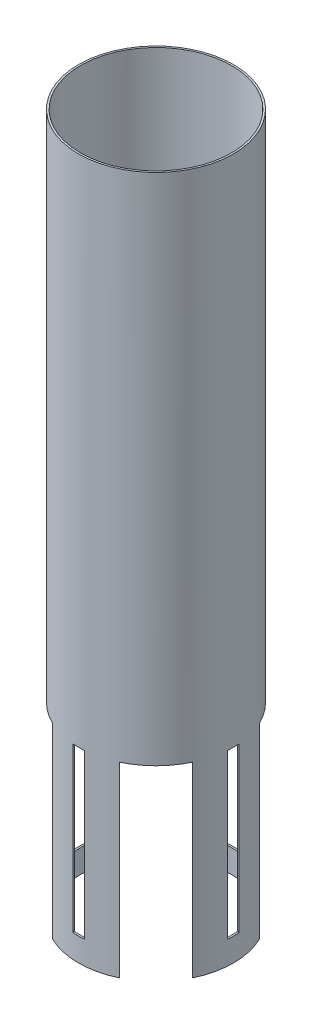
ISO-10303-21;
HEADER;
FILE_DESCRIPTION(('STEP AP214'),'2;1');
FILE_NAME('part.step','',(''),(''),'','','');
FILE_SCHEMA(('AUTOMOTIVE_DESIGN { 1 0 10303 214 1 1 1 1 }'));
ENDSEC;
DATA;
#1=APPLICATION_CONTEXT('core data for automotive mechanical design processes');
#2=APPLICATION_PROTOCOL_DEFINITION('international standard','automotive_design',2000,#1);
#3=PRODUCT_CONTEXT('',#1,'mechanical');
#4=PRODUCT('Part','Part','',(#3));
#5=PRODUCT_RELATED_PRODUCT_CATEGORY('part','',(#4));
#6=PRODUCT_DEFINITION_FORMATION('','',#4);
#7=PRODUCT_DEFINITION_CONTEXT('part definition',#1,'design');
#8=PRODUCT_DEFINITION('design','',#6,#7);
#9=PRODUCT_DEFINITION_SHAPE('','',#8);
#10=(LENGTH_UNIT() NAMED_UNIT(*) SI_UNIT(.MILLI.,.METRE.));
#11=(NAMED_UNIT(*) PLANE_ANGLE_UNIT() SI_UNIT($,.RADIAN.));
#12=(NAMED_UNIT(*) SI_UNIT($,.STERADIAN.) SOLID_ANGLE_UNIT());
#13=UNCERTAINTY_MEASURE_WITH_UNIT(LENGTH_MEASURE(1.E-05),#10,'distance_accuracy_value','');
#14=(GEOMETRIC_REPRESENTATION_CONTEXT(3) GLOBAL_UNCERTAINTY_ASSIGNED_CONTEXT((#13)) GLOBAL_UNIT_ASSIGNED_CONTEXT((#10,
#11,#12)) REPRESENTATION_CONTEXT('',''));
#15=CARTESIAN_POINT('',(0.,0.,0.));
#16=DIRECTION('',(0.,0.,1.));
#17=DIRECTION('',(1.,0.,0.));
#18=AXIS2_PLACEMENT_3D('',#15,#16,#17);
#19=CARTESIAN_POINT('',(0.,-150.,0.));
#20=DIRECTION('',(0.,1.,0.));
#21=DIRECTION('',(0.,0.,1.));
#22=AXIS2_PLACEMENT_3D('',#19,#20,#21);
#23=PLANE('',#22);
#24=CARTESIAN_POINT('',(0.,-150.,0.));
#25=DIRECTION('',(0.,1.,0.));
#26=DIRECTION('',(0.,0.,1.));
#27=AXIS2_PLACEMENT_3D('',#24,#25,#26);
#28=CIRCLE('',#27,32.385);
#29=CARTESIAN_POINT('',(-29.3163758294599,-150.,-13.7600266433558));
#30=VERTEX_POINT('',#29);
#31=CARTESIAN_POINT('',(-29.3163758294599,-150.,13.7600266433558));
#32=VERTEX_POINT('',#31);
#33=EDGE_CURVE('E469',#30,#32,#28,.T.);
#34=ORIENTED_EDGE('',*,*,#33,.T.);
#35=DIRECTION('',(0.707106781186549,0.,-0.707106781186546));
#36=VECTOR('',#35,1.);
#37=CARTESIAN_POINT('',(-40.9381745930521,-150.,25.381825406948));
#38=LINE('',#37,#36);
#39=CARTESIAN_POINT('',(-29.8981384266572,-150.,14.3417892405531));
#40=VERTEX_POINT('',#39);
#41=EDGE_CURVE('E251',#40,#32,#38,.T.);
#42=ORIENTED_EDGE('',*,*,#41,.F.);
#43=CARTESIAN_POINT('',(0.,-150.,0.));
#44=DIRECTION('',(0.,1.,0.));
#45=DIRECTION('',(0.,0.,1.));
#46=AXIS2_PLACEMENT_3D('',#43,#44,#45);
#47=CIRCLE('',#46,33.16);
#48=CARTESIAN_POINT('',(-29.8981384266572,-150.,-14.3417892405531));
#49=VERTEX_POINT('',#48);
#50=EDGE_CURVE('E506',#49,#40,#47,.T.);
#51=ORIENTED_EDGE('',*,*,#50,.F.);
#52=DIRECTION('',(0.707106781186549,0.,0.707106781186546));
#53=VECTOR('',#52,1.);
#54=CARTESIAN_POINT('',(-40.9381745930521,-150.,-25.381825406948));
#55=LINE('',#54,#53);
#56=EDGE_CURVE('E491',#49,#30,#55,.T.);
#57=ORIENTED_EDGE('',*,*,#56,.T.);
#58=EDGE_LOOP('',(#34,#42,#51,#57));
#59=FACE_BOUND('',#58,.T.);
#60=ADVANCED_FACE('F32',(#59),#23,.F.);
#61=CARTESIAN_POINT('',(13.7600266433561,-150.,-29.3163758294597));
#62=VERTEX_POINT('',#61);
#63=CARTESIAN_POINT('',(-13.7600266433559,-150.,-29.3163758294598));
#64=VERTEX_POINT('',#63);
#65=EDGE_CURVE('E392',#62,#64,#28,.T.);
#66=ORIENTED_EDGE('',*,*,#65,.T.);
#67=DIRECTION('',(0.707106781186549,0.,0.707106781186546));
#68=VECTOR('',#67,1.);
#69=CARTESIAN_POINT('',(-25.3818254069481,-150.,-40.938174593052));
#70=LINE('',#69,#68);
#71=CARTESIAN_POINT('',(-14.3417892405532,-150.,-29.8981384266572));
#72=VERTEX_POINT('',#71);
#73=EDGE_CURVE('E482',#72,#64,#70,.T.);
#74=ORIENTED_EDGE('',*,*,#73,.F.);
#75=CARTESIAN_POINT('',(14.3417892405534,-150.,-29.898138426657));
#76=VERTEX_POINT('',#75);
#77=EDGE_CURVE('E398',#76,#72,#47,.T.);
#78=ORIENTED_EDGE('',*,*,#77,.F.);
#79=DIRECTION('',(-0.707106781186554,0.,0.707106781186541));
#80=VECTOR('',#79,1.);
#81=CARTESIAN_POINT('',(25.3818254069485,-150.,-40.938174593052));
#82=LINE('',#81,#80);
#83=EDGE_CURVE('E484',#76,#62,#82,.T.);
#84=ORIENTED_EDGE('',*,*,#83,.T.);
#85=EDGE_LOOP('',(#66,#74,#78,#84));
#86=FACE_BOUND('',#85,.T.);
#87=ADVANCED_FACE('F480',(#86),#23,.F.);
#88=CARTESIAN_POINT('',(29.3163758294599,-150.,13.7600266433558));
#89=VERTEX_POINT('',#88);
#90=CARTESIAN_POINT('',(29.31637582946,-150.,-13.7600266433555));
#91=VERTEX_POINT('',#90);
#92=EDGE_CURVE('E389',#89,#91,#28,.T.);
#93=ORIENTED_EDGE('',*,*,#92,.T.);
#94=DIRECTION('',(-0.707106781186554,0.,0.707106781186541));
#95=VECTOR('',#94,1.);
#96=CARTESIAN_POINT('',(40.9381745930524,-150.,-25.3818254069478));
#97=LINE('',#96,#95);
#98=CARTESIAN_POINT('',(29.8981384266573,-150.,-14.3417892405529));
#99=VERTEX_POINT('',#98);
#100=EDGE_CURVE('E501',#99,#91,#97,.T.);
#101=ORIENTED_EDGE('',*,*,#100,.F.);
#102=CARTESIAN_POINT('',(29.8981384266572,-150.,14.3417892405531));
#103=VERTEX_POINT('',#102);
#104=EDGE_CURVE('E266',#103,#99,#47,.T.);
#105=ORIENTED_EDGE('',*,*,#104,.F.);
#106=DIRECTION('',(-0.707106781186549,0.,-0.707106781186546));
#107=VECTOR('',#106,1.);
#108=CARTESIAN_POINT('',(40.9381745930522,-150.,25.3818254069481));
#109=LINE('',#108,#107);
#110=EDGE_CURVE('E293',#103,#89,#109,.T.);
#111=ORIENTED_EDGE('',*,*,#110,.T.);
#112=EDGE_LOOP('',(#93,#101,#105,#111));
#113=FACE_BOUND('',#112,.T.);
#114=ADVANCED_FACE('F517',(#113),#23,.F.);
#115=CARTESIAN_POINT('',(0.,150.,0.));
#116=DIRECTION('',(0.,1.,0.));
#117=DIRECTION('',(0.,0.,1.));
#118=AXIS2_PLACEMENT_3D('',#115,#116,#117);
#119=PLANE('',#118);
#120=CARTESIAN_POINT('',(0.,150.,0.));
#121=DIRECTION('',(0.,1.,0.));
#122=DIRECTION('',(0.,0.,1.));
#123=AXIS2_PLACEMENT_3D('',#120,#121,#122);
#124=CIRCLE('',#123,33.16);
#125=CARTESIAN_POINT('',(0.,150.,33.16));
#126=VERTEX_POINT('',#125);
#127=EDGE_CURVE('E393',#126,#126,#124,.T.);
#128=ORIENTED_EDGE('',*,*,#127,.T.);
#129=EDGE_LOOP('',(#128));
#130=FACE_BOUND('',#129,.T.);
#131=CARTESIAN_POINT('',(0.,150.,0.));
#132=DIRECTION('',(0.,1.,0.));
#133=DIRECTION('',(0.,0.,1.));
#134=AXIS2_PLACEMENT_3D('',#131,#132,#133);
#135=CIRCLE('',#134,32.385);
#136=CARTESIAN_POINT('',(0.,150.,32.385));
#137=VERTEX_POINT('',#136);
#138=EDGE_CURVE('E385',#137,#137,#135,.T.);
#139=ORIENTED_EDGE('',*,*,#138,.F.);
#140=EDGE_LOOP('',(#139));
#141=FACE_BOUND('',#140,.T.);
#142=ADVANCED_FACE('F537',(#130,#141),#119,.T.);
#143=CARTESIAN_POINT('',(-14.3417892405532,-150.,29.8981384266571));
#144=VERTEX_POINT('',#143);
#145=CARTESIAN_POINT('',(14.3417892405532,-150.,29.8981384266572));
#146=VERTEX_POINT('',#145);
#147=EDGE_CURVE('E388',#144,#146,#47,.T.);
#148=ORIENTED_EDGE('',*,*,#147,.F.);
#149=DIRECTION('',(0.707106781186549,0.,-0.707106781186546));
#150=VECTOR('',#149,1.);
#151=CARTESIAN_POINT('',(-25.3818254069481,-150.,40.938174593052));
#152=LINE('',#151,#150);
#153=CARTESIAN_POINT('',(-13.7600266433559,-150.,29.3163758294598));
#154=VERTEX_POINT('',#153);
#155=EDGE_CURVE('E453',#144,#154,#152,.T.);
#156=ORIENTED_EDGE('',*,*,#155,.T.);
#157=CARTESIAN_POINT('',(13.7600266433559,-150.,29.3163758294598));
#158=VERTEX_POINT('',#157);
#159=EDGE_CURVE('E384',#154,#158,#28,.T.);
#160=ORIENTED_EDGE('',*,*,#159,.T.);
#161=DIRECTION('',(-0.707106781186549,0.,-0.707106781186546));
#162=VECTOR('',#161,1.);
#163=CARTESIAN_POINT('',(25.3818254069482,-150.,40.9381745930522));
#164=LINE('',#163,#162);
#165=EDGE_CURVE('E289',#146,#158,#164,.T.);
#166=ORIENTED_EDGE('',*,*,#165,.F.);
#167=EDGE_LOOP('',(#148,#156,#160,#166));
#168=FACE_BOUND('',#167,.T.);
#169=ADVANCED_FACE('F461',(#168),#23,.F.);
#170=CARTESIAN_POINT('',(0.,150.,0.));
#171=DIRECTION('',(0.,-1.,0.));
#172=DIRECTION('',(0.,0.,-1.));
#173=AXIS2_PLACEMENT_3D('',#170,#171,#172);
#174=CYLINDRICAL_SURFACE('',#173,33.16);
#175=ORIENTED_EDGE('',*,*,#50,.T.);
#176=DIRECTION('',(0.,-1.,0.));
#177=VECTOR('',#176,1.);
#178=CARTESIAN_POINT('',(-29.8981384266572,150.,14.3417892405531));
#179=LINE('',#178,#177);
#180=CARTESIAN_POINT('',(-29.8981384266572,-70.,14.3417892405531));
#181=VERTEX_POINT('',#180);
#182=EDGE_CURVE('E285',#40,#181,#179,.F.);
#183=ORIENTED_EDGE('',*,*,#182,.T.);
#184=CARTESIAN_POINT('',(0.,-70.,0.));
#185=DIRECTION('',(0.,1.,0.));
#186=DIRECTION('',(-1.,0.,0.));
#187=AXIS2_PLACEMENT_3D('',#184,#185,#186);
#188=CIRCLE('',#187,33.16);
#189=CARTESIAN_POINT('',(-14.3417892405532,-70.,29.8981384266572));
#190=VERTEX_POINT('',#189);
#191=EDGE_CURVE('E279',#181,#190,#188,.T.);
#192=ORIENTED_EDGE('',*,*,#191,.T.);
#193=DIRECTION('',(0.,-1.,0.));
#194=VECTOR('',#193,1.);
#195=CARTESIAN_POINT('',(-14.3417892405532,150.,29.8981384266572));
#196=LINE('',#195,#194);
#197=EDGE_CURVE('E282',#190,#144,#196,.T.);
#198=ORIENTED_EDGE('',*,*,#197,.T.);
#199=ORIENTED_EDGE('',*,*,#147,.T.);
#200=DIRECTION('',(0.,-1.,0.));
#201=VECTOR('',#200,1.);
#202=CARTESIAN_POINT('',(14.3417892405532,150.,29.8981384266571));
#203=LINE('',#202,#201);
#204=CARTESIAN_POINT('',(14.3417892405532,-70.,29.8981384266572));
#205=VERTEX_POINT('',#204);
#206=EDGE_CURVE('E304',#146,#205,#203,.F.);
#207=ORIENTED_EDGE('',*,*,#206,.T.);
#208=CARTESIAN_POINT('',(0.,-70.,0.));
#209=DIRECTION('',(0.,1.,0.));
#210=DIRECTION('',(-1.,0.,0.));
#211=AXIS2_PLACEMENT_3D('',#208,#209,#210);
#212=CIRCLE('',#211,33.16);
#213=CARTESIAN_POINT('',(29.8981384266572,-70.,14.3417892405531));
#214=VERTEX_POINT('',#213);
#215=EDGE_CURVE('E292',#205,#214,#212,.T.);
#216=ORIENTED_EDGE('',*,*,#215,.T.);
#217=DIRECTION('',(0.,-1.,0.));
#218=VECTOR('',#217,1.);
#219=CARTESIAN_POINT('',(29.8981384266572,150.,14.341789240553));
#220=LINE('',#219,#218);
#221=EDGE_CURVE('E302',#214,#103,#220,.T.);
#222=ORIENTED_EDGE('',*,*,#221,.T.);
#223=ORIENTED_EDGE('',*,*,#104,.T.);
#224=DIRECTION('',(0.,-1.,0.));
#225=VECTOR('',#224,1.);
#226=CARTESIAN_POINT('',(29.8981384266573,150.,-14.3417892405529));
#227=LINE('',#226,#225);
#228=CARTESIAN_POINT('',(29.8981384266573,-70.,-14.3417892405529));
#229=VERTEX_POINT('',#228);
#230=EDGE_CURVE('E255',#99,#229,#227,.F.);
#231=ORIENTED_EDGE('',*,*,#230,.T.);
#232=CARTESIAN_POINT('',(0.,-70.,0.));
#233=DIRECTION('',(0.,1.,0.));
#234=DIRECTION('',(-1.,0.,0.));
#235=AXIS2_PLACEMENT_3D('',#232,#233,#234);
#236=CIRCLE('',#235,33.16);
#237=CARTESIAN_POINT('',(14.3417892405534,-70.,-29.898138426657));
#238=VERTEX_POINT('',#237);
#239=EDGE_CURVE('E240',#229,#238,#236,.T.);
#240=ORIENTED_EDGE('',*,*,#239,.T.);
#241=DIRECTION('',(0.,-1.,0.));
#242=VECTOR('',#241,1.);
#243=CARTESIAN_POINT('',(14.3417892405534,150.,-29.8981384266571));
#244=LINE('',#243,#242);
#245=EDGE_CURVE('E250',#238,#76,#244,.T.);
#246=ORIENTED_EDGE('',*,*,#245,.T.);
#247=ORIENTED_EDGE('',*,*,#77,.T.);
#248=DIRECTION('',(0.,-1.,0.));
#249=VECTOR('',#248,1.);
#250=CARTESIAN_POINT('',(-14.3417892405532,150.,-29.8981384266571));
#251=LINE('',#250,#249);
#252=CARTESIAN_POINT('',(-14.3417892405532,-70.,-29.8981384266572));
#253=VERTEX_POINT('',#252);
#254=EDGE_CURVE('E276',#72,#253,#251,.F.);
#255=ORIENTED_EDGE('',*,*,#254,.T.);
#256=CARTESIAN_POINT('',(0.,-70.,0.));
#257=DIRECTION('',(0.,1.,0.));
#258=DIRECTION('',(-1.,0.,0.));
#259=AXIS2_PLACEMENT_3D('',#256,#257,#258);
#260=CIRCLE('',#259,33.16);
#261=CARTESIAN_POINT('',(-29.8981384266572,-70.,-14.3417892405531));
#262=VERTEX_POINT('',#261);
#263=EDGE_CURVE('E267',#253,#262,#260,.T.);
#264=ORIENTED_EDGE('',*,*,#263,.T.);
#265=DIRECTION('',(0.,-1.,0.));
#266=VECTOR('',#265,1.);
#267=CARTESIAN_POINT('',(-29.8981384266572,150.,-14.341789240553));
#268=LINE('',#267,#266);
#269=EDGE_CURVE('E270',#262,#49,#268,.T.);
#270=ORIENTED_EDGE('',*,*,#269,.T.);
#271=EDGE_LOOP('',(#175,#183,#192,#198,#199,#207,#216,#222,#223,#231,#240,#246,#247,#255,#264,#270));
#272=FACE_BOUND('',#271,.T.);
#273=DIRECTION('',(0.,-1.,0.));
#274=VECTOR('',#273,1.);
#275=CARTESIAN_POINT('',(-33.0656256556564,150.,-2.49999999999991));
#276=LINE('',#275,#274);
#277=CARTESIAN_POINT('',(-33.0656256556564,-140.,-2.49999999999991));
#278=VERTEX_POINT('',#277);
#279=CARTESIAN_POINT('',(-33.0656256556564,-70.,-2.49999999999991));
#280=VERTEX_POINT('',#279);
#281=EDGE_CURVE('E356',#278,#280,#276,.F.);
#282=ORIENTED_EDGE('',*,*,#281,.T.);
#283=CARTESIAN_POINT('',(0.,-70.,0.));
#284=DIRECTION('',(0.,1.,0.));
#285=DIRECTION('',(0.,0.,1.));
#286=AXIS2_PLACEMENT_3D('',#283,#284,#285);
#287=CIRCLE('',#286,33.16);
#288=CARTESIAN_POINT('',(-33.0656256556564,-70.,2.50000000000009));
#289=VERTEX_POINT('',#288);
#290=EDGE_CURVE('E348',#280,#289,#287,.T.);
#291=ORIENTED_EDGE('',*,*,#290,.T.);
#292=DIRECTION('',(0.,-1.,0.));
#293=VECTOR('',#292,1.);
#294=CARTESIAN_POINT('',(-33.0656256556564,150.,2.50000000000009));
#295=LINE('',#294,#293);
#296=CARTESIAN_POINT('',(-33.0656256556564,-140.,2.50000000000009));
#297=VERTEX_POINT('',#296);
#298=EDGE_CURVE('E350',#289,#297,#295,.T.);
#299=ORIENTED_EDGE('',*,*,#298,.T.);
#300=CARTESIAN_POINT('',(0.,-140.,0.));
#301=DIRECTION('',(0.,-1.,0.));
#302=DIRECTION('',(0.,0.,-1.));
#303=AXIS2_PLACEMENT_3D('',#300,#301,#302);
#304=CIRCLE('',#303,33.16);
#305=EDGE_CURVE('E353',#297,#278,#304,.T.);
#306=ORIENTED_EDGE('',*,*,#305,.T.);
#307=EDGE_LOOP('',(#282,#291,#299,#306));
#308=FACE_BOUND('',#307,.T.);
#309=DIRECTION('',(0.,-1.,0.));
#310=VECTOR('',#309,1.);
#311=CARTESIAN_POINT('',(2.49999999999997,150.,33.0656256556564));
#312=LINE('',#311,#310);
#313=CARTESIAN_POINT('',(2.49999999999997,-70.,33.0656256556564));
#314=VERTEX_POINT('',#313);
#315=CARTESIAN_POINT('',(2.49999999999997,-140.,33.0656256556564));
#316=VERTEX_POINT('',#315);
#317=EDGE_CURVE('E340',#314,#316,#312,.T.);
#318=ORIENTED_EDGE('',*,*,#317,.T.);
#319=CARTESIAN_POINT('',(-2.50000000000003,-140.,33.0656256556564));
#320=VERTEX_POINT('',#319);
#321=EDGE_CURVE('E357',#316,#320,#304,.T.);
#322=ORIENTED_EDGE('',*,*,#321,.T.);
#323=DIRECTION('',(0.,-1.,0.));
#324=VECTOR('',#323,1.);
#325=CARTESIAN_POINT('',(-2.50000000000003,150.,33.0656256556564));
#326=LINE('',#325,#324);
#327=CARTESIAN_POINT('',(-2.50000000000003,-70.,33.0656256556564));
#328=VERTEX_POINT('',#327);
#329=EDGE_CURVE('E343',#320,#328,#326,.F.);
#330=ORIENTED_EDGE('',*,*,#329,.T.);
#331=EDGE_CURVE('E346',#328,#314,#287,.T.);
#332=ORIENTED_EDGE('',*,*,#331,.T.);
#333=EDGE_LOOP('',(#318,#322,#330,#332));
#334=FACE_BOUND('',#333,.T.);
#335=DIRECTION('',(0.,-1.,0.));
#336=VECTOR('',#335,1.);
#337=CARTESIAN_POINT('',(33.0656256556563,150.,-2.50000000000014));
#338=LINE('',#337,#336);
#339=CARTESIAN_POINT('',(33.0656256556563,-70.,-2.50000000000014));
#340=VERTEX_POINT('',#339);
#341=CARTESIAN_POINT('',(33.0656256556563,-140.,-2.50000000000014));
#342=VERTEX_POINT('',#341);
#343=EDGE_CURVE('E360',#340,#342,#338,.T.);
#344=ORIENTED_EDGE('',*,*,#343,.T.);
#345=CARTESIAN_POINT('',(33.0656256556564,-140.,2.49999999999968));
#346=VERTEX_POINT('',#345);
#347=EDGE_CURVE('E354',#342,#346,#304,.T.);
#348=ORIENTED_EDGE('',*,*,#347,.T.);
#349=DIRECTION('',(0.,-1.,0.));
#350=VECTOR('',#349,1.);
#351=CARTESIAN_POINT('',(33.0656256556564,150.,2.49999999999968));
#352=LINE('',#351,#350);
#353=CARTESIAN_POINT('',(33.0656256556564,-70.,2.49999999999968));
#354=VERTEX_POINT('',#353);
#355=EDGE_CURVE('E337',#346,#354,#352,.F.);
#356=ORIENTED_EDGE('',*,*,#355,.T.);
#357=EDGE_CURVE('E349',#354,#340,#287,.T.);
#358=ORIENTED_EDGE('',*,*,#357,.T.);
#359=EDGE_LOOP('',(#344,#348,#356,#358));
#360=FACE_BOUND('',#359,.T.);
#361=DIRECTION('',(0.,-1.,0.));
#362=VECTOR('',#361,1.);
#363=CARTESIAN_POINT('',(2.50000000000003,150.,-33.0656256556564));
#364=LINE('',#363,#362);
#365=CARTESIAN_POINT('',(2.50000000000003,-140.,-33.0656256556564));
#366=VERTEX_POINT('',#365);
#367=CARTESIAN_POINT('',(2.50000000000003,-70.,-33.0656256556564));
#368=VERTEX_POINT('',#367);
#369=EDGE_CURVE('E381',#366,#368,#364,.F.);
#370=ORIENTED_EDGE('',*,*,#369,.T.);
#371=CARTESIAN_POINT('',(0.,-70.,0.));
#372=DIRECTION('',(0.,1.,0.));
#373=DIRECTION('',(0.,0.,1.));
#374=AXIS2_PLACEMENT_3D('',#371,#372,#373);
#375=CIRCLE('',#374,33.16);
#376=CARTESIAN_POINT('',(-2.49999999999997,-70.,-33.0656256556564));
#377=VERTEX_POINT('',#376);
#378=EDGE_CURVE('E367',#368,#377,#375,.T.);
#379=ORIENTED_EDGE('',*,*,#378,.T.);
#380=DIRECTION('',(0.,-1.,0.));
#381=VECTOR('',#380,1.);
#382=CARTESIAN_POINT('',(-2.49999999999997,150.,-33.0656256556564));
#383=LINE('',#382,#381);
#384=CARTESIAN_POINT('',(-2.49999999999997,-140.,-33.0656256556564));
#385=VERTEX_POINT('',#384);
#386=EDGE_CURVE('E376',#377,#385,#383,.T.);
#387=ORIENTED_EDGE('',*,*,#386,.T.);
#388=CARTESIAN_POINT('',(0.,-140.,0.));
#389=DIRECTION('',(0.,-1.,0.));
#390=DIRECTION('',(1.,0.,0.));
#391=AXIS2_PLACEMENT_3D('',#388,#389,#390);
#392=CIRCLE('',#391,33.16);
#393=EDGE_CURVE('E379',#385,#366,#392,.T.);
#394=ORIENTED_EDGE('',*,*,#393,.T.);
#395=EDGE_LOOP('',(#370,#379,#387,#394));
#396=FACE_BOUND('',#395,.T.);
#397=ORIENTED_EDGE('',*,*,#127,.F.);
#398=EDGE_LOOP('',(#397));
#399=FACE_BOUND('',#398,.T.);
#400=ADVANCED_FACE('F34',(#272,#308,#334,#360,#396,#399),#174,.T.);
#401=CARTESIAN_POINT('',(0.,150.,0.));
#402=DIRECTION('',(0.,-1.,0.));
#403=DIRECTION('',(0.,0.,-1.));
#404=AXIS2_PLACEMENT_3D('',#401,#402,#403);
#405=CYLINDRICAL_SURFACE('',#404,32.385);
#406=DIRECTION('',(0.,-1.,0.));
#407=VECTOR('',#406,1.);
#408=CARTESIAN_POINT('',(-29.3163758294599,150.,13.7600266433558));
#409=LINE('',#408,#407);
#410=CARTESIAN_POINT('',(-29.3163758294599,-70.,13.7600266433558));
#411=VERTEX_POINT('',#410);
#412=EDGE_CURVE('E11',#32,#411,#409,.F.);
#413=ORIENTED_EDGE('',*,*,#412,.F.);
#414=ORIENTED_EDGE('',*,*,#33,.F.);
#415=DIRECTION('',(0.,-1.,0.));
#416=VECTOR('',#415,1.);
#417=CARTESIAN_POINT('',(-29.3163758294599,150.,-13.7600266433557));
#418=LINE('',#417,#416);
#419=CARTESIAN_POINT('',(-29.3163758294599,-70.,-13.7600266433558));
#420=VERTEX_POINT('',#419);
#421=EDGE_CURVE('E443',#420,#30,#418,.T.);
#422=ORIENTED_EDGE('',*,*,#421,.F.);
#423=CARTESIAN_POINT('',(0.,-70.,0.));
#424=DIRECTION('',(0.,1.,0.));
#425=DIRECTION('',(-1.,0.,0.));
#426=AXIS2_PLACEMENT_3D('',#423,#424,#425);
#427=CIRCLE('',#426,32.385);
#428=CARTESIAN_POINT('',(-13.7600266433559,-70.,-29.3163758294598));
#429=VERTEX_POINT('',#428);
#430=EDGE_CURVE('E441',#429,#420,#427,.T.);
#431=ORIENTED_EDGE('',*,*,#430,.F.);
#432=DIRECTION('',(0.,-1.,0.));
#433=VECTOR('',#432,1.);
#434=CARTESIAN_POINT('',(-13.7600266433559,150.,-29.3163758294598));
#435=LINE('',#434,#433);
#436=EDGE_CURVE('E445',#64,#429,#435,.F.);
#437=ORIENTED_EDGE('',*,*,#436,.F.);
#438=ORIENTED_EDGE('',*,*,#65,.F.);
#439=DIRECTION('',(0.,-1.,0.));
#440=VECTOR('',#439,1.);
#441=CARTESIAN_POINT('',(13.760026643356,150.,-29.3163758294597));
#442=LINE('',#441,#440);
#443=CARTESIAN_POINT('',(13.7600266433561,-70.,-29.3163758294597));
#444=VERTEX_POINT('',#443);
#445=EDGE_CURVE('E438',#444,#62,#442,.T.);
#446=ORIENTED_EDGE('',*,*,#445,.F.);
#447=CARTESIAN_POINT('',(0.,-70.,0.));
#448=DIRECTION('',(0.,1.,0.));
#449=DIRECTION('',(-1.,0.,0.));
#450=AXIS2_PLACEMENT_3D('',#447,#448,#449);
#451=CIRCLE('',#450,32.385);
#452=CARTESIAN_POINT('',(29.31637582946,-70.,-13.7600266433556));
#453=VERTEX_POINT('',#452);
#454=EDGE_CURVE('E436',#453,#444,#451,.T.);
#455=ORIENTED_EDGE('',*,*,#454,.F.);
#456=DIRECTION('',(0.,-1.,0.));
#457=VECTOR('',#456,1.);
#458=CARTESIAN_POINT('',(29.31637582946,150.,-13.7600266433556));
#459=LINE('',#458,#457);
#460=EDGE_CURVE('E258',#91,#453,#459,.F.);
#461=ORIENTED_EDGE('',*,*,#460,.F.);
#462=ORIENTED_EDGE('',*,*,#92,.F.);
#463=DIRECTION('',(0.,-1.,0.));
#464=VECTOR('',#463,1.);
#465=CARTESIAN_POINT('',(29.3163758294599,150.,13.7600266433557));
#466=LINE('',#465,#464);
#467=CARTESIAN_POINT('',(29.3163758294599,-70.,13.7600266433558));
#468=VERTEX_POINT('',#467);
#469=EDGE_CURVE('E431',#468,#89,#466,.T.);
#470=ORIENTED_EDGE('',*,*,#469,.F.);
#471=CARTESIAN_POINT('',(0.,-70.,0.));
#472=DIRECTION('',(0.,1.,0.));
#473=DIRECTION('',(-1.,0.,0.));
#474=AXIS2_PLACEMENT_3D('',#471,#472,#473);
#475=CIRCLE('',#474,32.385);
#476=CARTESIAN_POINT('',(13.7600266433559,-70.,29.3163758294598));
#477=VERTEX_POINT('',#476);
#478=EDGE_CURVE('E429',#477,#468,#475,.T.);
#479=ORIENTED_EDGE('',*,*,#478,.F.);
#480=DIRECTION('',(0.,-1.,0.));
#481=VECTOR('',#480,1.);
#482=CARTESIAN_POINT('',(13.7600266433559,150.,29.3163758294598));
#483=LINE('',#482,#481);
#484=EDGE_CURVE('E433',#158,#477,#483,.F.);
#485=ORIENTED_EDGE('',*,*,#484,.F.);
#486=ORIENTED_EDGE('',*,*,#159,.F.);
#487=DIRECTION('',(0.,-1.,0.));
#488=VECTOR('',#487,1.);
#489=CARTESIAN_POINT('',(-13.7600266433558,150.,29.3163758294598));
#490=LINE('',#489,#488);
#491=CARTESIAN_POINT('',(-13.7600266433559,-70.,29.3163758294598));
#492=VERTEX_POINT('',#491);
#493=EDGE_CURVE('E40',#492,#154,#490,.T.);
#494=ORIENTED_EDGE('',*,*,#493,.F.);
#495=CARTESIAN_POINT('',(0.,-70.,0.));
#496=DIRECTION('',(0.,1.,0.));
#497=DIRECTION('',(-1.,0.,0.));
#498=AXIS2_PLACEMENT_3D('',#495,#496,#497);
#499=CIRCLE('',#498,32.385);
#500=EDGE_CURVE('E447',#411,#492,#499,.T.);
#501=ORIENTED_EDGE('',*,*,#500,.F.);
#502=EDGE_LOOP('',(#413,#414,#422,#431,#437,#438,#446,#455,#461,#462,#470,#479,#485,#486,#494,#501));
#503=FACE_BOUND('',#502,.T.);
#504=DIRECTION('',(0.,-1.,0.));
#505=VECTOR('',#504,1.);
#506=CARTESIAN_POINT('',(-32.2883605189238,150.,-2.49999999999991));
#507=LINE('',#506,#505);
#508=CARTESIAN_POINT('',(-32.2883605189238,-140.,-2.49999999999992));
#509=VERTEX_POINT('',#508);
#510=CARTESIAN_POINT('',(-32.2883605189238,-70.,-2.49999999999992));
#511=VERTEX_POINT('',#510);
#512=EDGE_CURVE('E426',#509,#511,#507,.F.);
#513=ORIENTED_EDGE('',*,*,#512,.F.);
#514=CARTESIAN_POINT('',(0.,-140.,0.));
#515=DIRECTION('',(0.,-1.,0.));
#516=DIRECTION('',(0.,0.,-1.));
#517=AXIS2_PLACEMENT_3D('',#514,#515,#516);
#518=CIRCLE('',#517,32.385);
#519=CARTESIAN_POINT('',(-32.2883605189238,-140.,2.50000000000008));
#520=VERTEX_POINT('',#519);
#521=EDGE_CURVE('E417',#520,#509,#518,.T.);
#522=ORIENTED_EDGE('',*,*,#521,.F.);
#523=DIRECTION('',(0.,-1.,0.));
#524=VECTOR('',#523,1.);
#525=CARTESIAN_POINT('',(-32.2883605189238,150.,2.50000000000008));
#526=LINE('',#525,#524);
#527=CARTESIAN_POINT('',(-32.2883605189238,-70.,2.50000000000008));
#528=VERTEX_POINT('',#527);
#529=EDGE_CURVE('E424',#528,#520,#526,.T.);
#530=ORIENTED_EDGE('',*,*,#529,.F.);
#531=CARTESIAN_POINT('',(0.,-70.,0.));
#532=DIRECTION('',(0.,1.,0.));
#533=DIRECTION('',(0.,0.,1.));
#534=AXIS2_PLACEMENT_3D('',#531,#532,#533);
#535=CIRCLE('',#534,32.385);
#536=EDGE_CURVE('E412',#511,#528,#535,.T.);
#537=ORIENTED_EDGE('',*,*,#536,.F.);
#538=EDGE_LOOP('',(#513,#522,#530,#537));
#539=FACE_BOUND('',#538,.T.);
#540=DIRECTION('',(0.,-1.,0.));
#541=VECTOR('',#540,1.);
#542=CARTESIAN_POINT('',(-2.50000000000003,150.,32.2883605189238));
#543=LINE('',#542,#541);
#544=CARTESIAN_POINT('',(-2.50000000000003,-140.,32.2883605189238));
#545=VERTEX_POINT('',#544);
#546=CARTESIAN_POINT('',(-2.50000000000003,-70.,32.2883605189238));
#547=VERTEX_POINT('',#546);
#548=EDGE_CURVE('E422',#545,#547,#543,.F.);
#549=ORIENTED_EDGE('',*,*,#548,.F.);
#550=CARTESIAN_POINT('',(2.49999999999997,-140.,32.2883605189238));
#551=VERTEX_POINT('',#550);
#552=EDGE_CURVE('E418',#551,#545,#518,.T.);
#553=ORIENTED_EDGE('',*,*,#552,.F.);
#554=DIRECTION('',(0.,-1.,0.));
#555=VECTOR('',#554,1.);
#556=CARTESIAN_POINT('',(2.49999999999997,150.,32.2883605189238));
#557=LINE('',#556,#555);
#558=CARTESIAN_POINT('',(2.49999999999997,-70.,32.2883605189238));
#559=VERTEX_POINT('',#558);
#560=EDGE_CURVE('E420',#559,#551,#557,.T.);
#561=ORIENTED_EDGE('',*,*,#560,.F.);
#562=EDGE_CURVE('E413',#547,#559,#535,.T.);
#563=ORIENTED_EDGE('',*,*,#562,.F.);
#564=EDGE_LOOP('',(#549,#553,#561,#563));
#565=FACE_BOUND('',#564,.T.);
#566=DIRECTION('',(0.,-1.,0.));
#567=VECTOR('',#566,1.);
#568=CARTESIAN_POINT('',(32.2883605189238,150.,-2.50000000000014));
#569=LINE('',#568,#567);
#570=CARTESIAN_POINT('',(32.2883605189238,-70.,-2.50000000000014));
#571=VERTEX_POINT('',#570);
#572=CARTESIAN_POINT('',(32.2883605189238,-140.,-2.50000000000014));
#573=VERTEX_POINT('',#572);
#574=EDGE_CURVE('E416',#571,#573,#569,.T.);
#575=ORIENTED_EDGE('',*,*,#574,.F.);
#576=CARTESIAN_POINT('',(32.2883605189239,-70.,2.49999999999969));
#577=VERTEX_POINT('',#576);
#578=EDGE_CURVE('E409',#577,#571,#535,.T.);
#579=ORIENTED_EDGE('',*,*,#578,.F.);
#580=DIRECTION('',(0.,-1.,0.));
#581=VECTOR('',#580,1.);
#582=CARTESIAN_POINT('',(32.2883605189239,150.,2.49999999999969));
#583=LINE('',#582,#581);
#584=CARTESIAN_POINT('',(32.2883605189239,-140.,2.49999999999969));
#585=VERTEX_POINT('',#584);
#586=EDGE_CURVE('E407',#585,#577,#583,.F.);
#587=ORIENTED_EDGE('',*,*,#586,.F.);
#588=EDGE_CURVE('E411',#573,#585,#518,.T.);
#589=ORIENTED_EDGE('',*,*,#588,.F.);
#590=EDGE_LOOP('',(#575,#579,#587,#589));
#591=FACE_BOUND('',#590,.T.);
#592=DIRECTION('',(0.,-1.,0.));
#593=VECTOR('',#592,1.);
#594=CARTESIAN_POINT('',(2.50000000000003,150.,-32.2883605189238));
#595=LINE('',#594,#593);
#596=CARTESIAN_POINT('',(2.50000000000003,-140.,-32.2883605189238));
#597=VERTEX_POINT('',#596);
#598=CARTESIAN_POINT('',(2.50000000000003,-70.,-32.2883605189238));
#599=VERTEX_POINT('',#598);
#600=EDGE_CURVE('E404',#597,#599,#595,.F.);
#601=ORIENTED_EDGE('',*,*,#600,.F.);
#602=CARTESIAN_POINT('',(0.,-140.,0.));
#603=DIRECTION('',(0.,-1.,0.));
#604=DIRECTION('',(1.,0.,0.));
#605=AXIS2_PLACEMENT_3D('',#602,#603,#604);
#606=CIRCLE('',#605,32.385);
#607=CARTESIAN_POINT('',(-2.49999999999997,-140.,-32.2883605189238));
#608=VERTEX_POINT('',#607);
#609=EDGE_CURVE('E402',#608,#597,#606,.T.);
#610=ORIENTED_EDGE('',*,*,#609,.F.);
#611=DIRECTION('',(0.,-1.,0.));
#612=VECTOR('',#611,1.);
#613=CARTESIAN_POINT('',(-2.49999999999997,150.,-32.2883605189238));
#614=LINE('',#613,#612);
#615=CARTESIAN_POINT('',(-2.49999999999997,-70.,-32.2883605189238));
#616=VERTEX_POINT('',#615);
#617=EDGE_CURVE('E400',#616,#608,#614,.T.);
#618=ORIENTED_EDGE('',*,*,#617,.F.);
#619=CARTESIAN_POINT('',(0.,-70.,0.));
#620=DIRECTION('',(0.,1.,0.));
#621=DIRECTION('',(0.,0.,1.));
#622=AXIS2_PLACEMENT_3D('',#619,#620,#621);
#623=CIRCLE('',#622,32.385);
#624=EDGE_CURVE('E396',#599,#616,#623,.T.);
#625=ORIENTED_EDGE('',*,*,#624,.F.);
#626=EDGE_LOOP('',(#601,#610,#618,#625));
#627=FACE_BOUND('',#626,.T.);
#628=ORIENTED_EDGE('',*,*,#138,.T.);
#629=EDGE_LOOP('',(#628));
#630=FACE_BOUND('',#629,.T.);
#631=ADVANCED_FACE('F466',(#503,#539,#565,#591,#627,#630),#405,.F.);
#632=CARTESIAN_POINT('',(2.50000000000003,-140.,-33.16));
#633=DIRECTION('',(1.,0.,0.));
#634=DIRECTION('',(0.,1.,0.));
#635=AXIS2_PLACEMENT_3D('',#632,#633,#634);
#636=PLANE('',#635);
#637=DIRECTION('',(0.,0.,1.));
#638=VECTOR('',#637,1.);
#639=CARTESIAN_POINT('',(2.50000000000003,-140.,-33.16));
#640=LINE('',#639,#638);
#641=EDGE_CURVE('E364',#366,#597,#640,.T.);
#642=ORIENTED_EDGE('',*,*,#641,.T.);
#643=ORIENTED_EDGE('',*,*,#600,.T.);
#644=DIRECTION('',(0.,0.,1.));
#645=VECTOR('',#644,1.);
#646=CARTESIAN_POINT('',(2.50000000000003,-70.,-33.16));
#647=LINE('',#646,#645);
#648=EDGE_CURVE('E363',#368,#599,#647,.T.);
#649=ORIENTED_EDGE('',*,*,#648,.F.);
#650=ORIENTED_EDGE('',*,*,#369,.F.);
#651=EDGE_LOOP('',(#642,#643,#649,#650));
#652=FACE_BOUND('',#651,.T.);
#653=ADVANCED_FACE('F558',(#652),#636,.F.);
#654=CARTESIAN_POINT('',(-2.49999999999997,-140.,-33.16));
#655=DIRECTION('',(0.,-1.,0.));
#656=DIRECTION('',(1.,0.,0.));
#657=AXIS2_PLACEMENT_3D('',#654,#655,#656);
#658=PLANE('',#657);
#659=DIRECTION('',(0.,0.,1.));
#660=VECTOR('',#659,1.);
#661=CARTESIAN_POINT('',(-2.49999999999997,-140.,-33.16));
#662=LINE('',#661,#660);
#663=EDGE_CURVE('E368',#385,#608,#662,.T.);
#664=ORIENTED_EDGE('',*,*,#663,.T.);
#665=ORIENTED_EDGE('',*,*,#609,.T.);
#666=ORIENTED_EDGE('',*,*,#641,.F.);
#667=ORIENTED_EDGE('',*,*,#393,.F.);
#668=EDGE_LOOP('',(#664,#665,#666,#667));
#669=FACE_BOUND('',#668,.T.);
#670=ADVANCED_FACE('F563',(#669),#658,.F.);
#671=CARTESIAN_POINT('',(-2.49999999999997,-140.,-33.16));
#672=DIRECTION('',(-1.,0.,0.));
#673=DIRECTION('',(0.,0.,1.));
#674=AXIS2_PLACEMENT_3D('',#671,#672,#673);
#675=PLANE('',#674);
#676=DIRECTION('',(0.,0.,1.));
#677=VECTOR('',#676,1.);
#678=CARTESIAN_POINT('',(-2.49999999999997,-70.,-33.16));
#679=LINE('',#678,#677);
#680=EDGE_CURVE('E371',#377,#616,#679,.T.);
#681=ORIENTED_EDGE('',*,*,#680,.T.);
#682=ORIENTED_EDGE('',*,*,#617,.T.);
#683=ORIENTED_EDGE('',*,*,#663,.F.);
#684=ORIENTED_EDGE('',*,*,#386,.F.);
#685=EDGE_LOOP('',(#681,#682,#683,#684));
#686=FACE_BOUND('',#685,.T.);
#687=ADVANCED_FACE('F575',(#686),#675,.F.);
#688=CARTESIAN_POINT('',(-2.49999999999997,-70.,-33.16));
#689=DIRECTION('',(0.,1.,0.));
#690=DIRECTION('',(0.,0.,1.));
#691=AXIS2_PLACEMENT_3D('',#688,#689,#690);
#692=PLANE('',#691);
#693=ORIENTED_EDGE('',*,*,#648,.T.);
#694=ORIENTED_EDGE('',*,*,#624,.T.);
#695=ORIENTED_EDGE('',*,*,#680,.F.);
#696=ORIENTED_EDGE('',*,*,#378,.F.);
#697=EDGE_LOOP('',(#693,#694,#695,#696));
#698=FACE_BOUND('',#697,.T.);
#699=ADVANCED_FACE('F585',(#698),#692,.F.);
#700=CARTESIAN_POINT('',(33.1600000000004,-140.,2.49999999999968));
#701=DIRECTION('',(0.,0.,1.));
#702=DIRECTION('',(1.,0.,0.));
#703=AXIS2_PLACEMENT_3D('',#700,#701,#702);
#704=PLANE('',#703);
#705=DIRECTION('',(-1.,0.,0.));
#706=VECTOR('',#705,1.);
#707=CARTESIAN_POINT('',(33.1600000000004,-140.,2.49999999999968));
#708=LINE('',#707,#706);
#709=EDGE_CURVE('E308',#346,#585,#708,.T.);
#710=ORIENTED_EDGE('',*,*,#709,.T.);
#711=ORIENTED_EDGE('',*,*,#586,.T.);
#712=DIRECTION('',(-1.,0.,0.));
#713=VECTOR('',#712,1.);
#714=CARTESIAN_POINT('',(33.1600000000004,-70.,2.49999999999968));
#715=LINE('',#714,#713);
#716=EDGE_CURVE('E307',#354,#577,#715,.T.);
#717=ORIENTED_EDGE('',*,*,#716,.F.);
#718=ORIENTED_EDGE('',*,*,#355,.F.);
#719=EDGE_LOOP('',(#710,#711,#717,#718));
#720=FACE_BOUND('',#719,.T.);
#721=ADVANCED_FACE('F595',(#720),#704,.F.);
#722=CARTESIAN_POINT('',(-33.1600000000001,-70.,2.50000000000009));
#723=DIRECTION('',(0.,1.,0.));
#724=DIRECTION('',(0.,0.,1.));
#725=AXIS2_PLACEMENT_3D('',#722,#723,#724);
#726=PLANE('',#725);
#727=ORIENTED_EDGE('',*,*,#716,.T.);
#728=ORIENTED_EDGE('',*,*,#578,.T.);
#729=DIRECTION('',(1.,0.,0.));
#730=VECTOR('',#729,1.);
#731=CARTESIAN_POINT('',(-33.1600000000001,-70.,-2.49999999999991));
#732=LINE('',#731,#730);
#733=EDGE_CURVE('E316',#571,#340,#732,.T.);
#734=ORIENTED_EDGE('',*,*,#733,.T.);
#735=ORIENTED_EDGE('',*,*,#357,.F.);
#736=EDGE_LOOP('',(#727,#728,#734,#735));
#737=FACE_BOUND('',#736,.T.);
#738=ADVANCED_FACE('F605',(#737),#726,.F.);
#739=CARTESIAN_POINT('',(-33.1600000000001,-140.,2.50000000000009));
#740=DIRECTION('',(0.,-1.,0.));
#741=DIRECTION('',(0.,0.,-1.));
#742=AXIS2_PLACEMENT_3D('',#739,#740,#741);
#743=PLANE('',#742);
#744=DIRECTION('',(1.,0.,0.));
#745=VECTOR('',#744,1.);
#746=CARTESIAN_POINT('',(-33.1600000000001,-140.,-2.49999999999991));
#747=LINE('',#746,#745);
#748=EDGE_CURVE('E324',#573,#342,#747,.T.);
#749=ORIENTED_EDGE('',*,*,#748,.F.);
#750=ORIENTED_EDGE('',*,*,#588,.T.);
#751=ORIENTED_EDGE('',*,*,#709,.F.);
#752=ORIENTED_EDGE('',*,*,#347,.F.);
#753=EDGE_LOOP('',(#749,#750,#751,#752));
#754=FACE_BOUND('',#753,.T.);
#755=ADVANCED_FACE('F616',(#754),#743,.F.);
#756=CARTESIAN_POINT('',(-33.1600000000001,-140.,-2.49999999999991));
#757=DIRECTION('',(0.,0.,-1.));
#758=DIRECTION('',(-1.,0.,0.));
#759=AXIS2_PLACEMENT_3D('',#756,#757,#758);
#760=PLANE('',#759);
#761=ORIENTED_EDGE('',*,*,#733,.F.);
#762=ORIENTED_EDGE('',*,*,#574,.T.);
#763=ORIENTED_EDGE('',*,*,#748,.T.);
#764=ORIENTED_EDGE('',*,*,#343,.F.);
#765=EDGE_LOOP('',(#761,#762,#763,#764));
#766=FACE_BOUND('',#765,.T.);
#767=ADVANCED_FACE('F629',(#766),#760,.F.);
#768=CARTESIAN_POINT('',(-2.50000000000003,-140.,33.16));
#769=DIRECTION('',(-1.,0.,0.));
#770=DIRECTION('',(0.,-1.,0.));
#771=AXIS2_PLACEMENT_3D('',#768,#769,#770);
#772=PLANE('',#771);
#773=DIRECTION('',(0.,0.,-1.));
#774=VECTOR('',#773,1.);
#775=CARTESIAN_POINT('',(-2.50000000000003,-140.,33.16));
#776=LINE('',#775,#774);
#777=EDGE_CURVE('E313',#320,#545,#776,.T.);
#778=ORIENTED_EDGE('',*,*,#777,.T.);
#779=ORIENTED_EDGE('',*,*,#548,.T.);
#780=DIRECTION('',(0.,0.,-1.));
#781=VECTOR('',#780,1.);
#782=CARTESIAN_POINT('',(-2.50000000000003,-70.,33.16));
#783=LINE('',#782,#781);
#784=EDGE_CURVE('E310',#328,#547,#783,.T.);
#785=ORIENTED_EDGE('',*,*,#784,.F.);
#786=ORIENTED_EDGE('',*,*,#329,.F.);
#787=EDGE_LOOP('',(#778,#779,#785,#786));
#788=FACE_BOUND('',#787,.T.);
#789=ADVANCED_FACE('F643',(#788),#772,.F.);
#790=CARTESIAN_POINT('',(2.49999999999997,-140.,33.16));
#791=DIRECTION('',(1.,0.,0.));
#792=DIRECTION('',(0.,0.,-1.));
#793=AXIS2_PLACEMENT_3D('',#790,#791,#792);
#794=PLANE('',#793);
#795=DIRECTION('',(0.,0.,-1.));
#796=VECTOR('',#795,1.);
#797=CARTESIAN_POINT('',(2.49999999999997,-70.,33.16));
#798=LINE('',#797,#796);
#799=EDGE_CURVE('E320',#314,#559,#798,.T.);
#800=ORIENTED_EDGE('',*,*,#799,.T.);
#801=ORIENTED_EDGE('',*,*,#560,.T.);
#802=DIRECTION('',(0.,0.,-1.));
#803=VECTOR('',#802,1.);
#804=CARTESIAN_POINT('',(2.49999999999997,-140.,33.16));
#805=LINE('',#804,#803);
#806=EDGE_CURVE('E317',#316,#551,#805,.T.);
#807=ORIENTED_EDGE('',*,*,#806,.F.);
#808=ORIENTED_EDGE('',*,*,#317,.F.);
#809=EDGE_LOOP('',(#800,#801,#807,#808));
#810=FACE_BOUND('',#809,.T.);
#811=ADVANCED_FACE('F654',(#810),#794,.F.);
#812=ORIENTED_EDGE('',*,*,#331,.F.);
#813=ORIENTED_EDGE('',*,*,#784,.T.);
#814=ORIENTED_EDGE('',*,*,#562,.T.);
#815=ORIENTED_EDGE('',*,*,#799,.F.);
#816=EDGE_LOOP('',(#812,#813,#814,#815));
#817=FACE_BOUND('',#816,.T.);
#818=ADVANCED_FACE('F619',(#817),#726,.F.);
#819=ORIENTED_EDGE('',*,*,#806,.T.);
#820=ORIENTED_EDGE('',*,*,#552,.T.);
#821=ORIENTED_EDGE('',*,*,#777,.F.);
#822=ORIENTED_EDGE('',*,*,#321,.F.);
#823=EDGE_LOOP('',(#819,#820,#821,#822));
#824=FACE_BOUND('',#823,.T.);
#825=ADVANCED_FACE('F632',(#824),#743,.F.);
#826=EDGE_CURVE('E327',#278,#509,#747,.T.);
#827=ORIENTED_EDGE('',*,*,#826,.T.);
#828=ORIENTED_EDGE('',*,*,#512,.T.);
#829=EDGE_CURVE('E334',#280,#511,#732,.T.);
#830=ORIENTED_EDGE('',*,*,#829,.F.);
#831=ORIENTED_EDGE('',*,*,#281,.F.);
#832=EDGE_LOOP('',(#827,#828,#830,#831));
#833=FACE_BOUND('',#832,.T.);
#834=ADVANCED_FACE('F646',(#833),#760,.F.);
#835=DIRECTION('',(1.,0.,0.));
#836=VECTOR('',#835,1.);
#837=CARTESIAN_POINT('',(-33.1600000000001,-140.,2.50000000000009));
#838=LINE('',#837,#836);
#839=EDGE_CURVE('E328',#297,#520,#838,.T.);
#840=ORIENTED_EDGE('',*,*,#839,.T.);
#841=ORIENTED_EDGE('',*,*,#521,.T.);
#842=ORIENTED_EDGE('',*,*,#826,.F.);
#843=ORIENTED_EDGE('',*,*,#305,.F.);
#844=EDGE_LOOP('',(#840,#841,#842,#843));
#845=FACE_BOUND('',#844,.T.);
#846=ADVANCED_FACE('F633',(#845),#743,.F.);
#847=CARTESIAN_POINT('',(-33.1600000000001,-140.,2.50000000000009));
#848=DIRECTION('',(0.,0.,1.));
#849=DIRECTION('',(1.,0.,0.));
#850=AXIS2_PLACEMENT_3D('',#847,#848,#849);
#851=PLANE('',#850);
#852=DIRECTION('',(1.,0.,0.));
#853=VECTOR('',#852,1.);
#854=CARTESIAN_POINT('',(-33.1600000000001,-70.,2.50000000000009));
#855=LINE('',#854,#853);
#856=EDGE_CURVE('E331',#289,#528,#855,.T.);
#857=ORIENTED_EDGE('',*,*,#856,.T.);
#858=ORIENTED_EDGE('',*,*,#529,.T.);
#859=ORIENTED_EDGE('',*,*,#839,.F.);
#860=ORIENTED_EDGE('',*,*,#298,.F.);
#861=EDGE_LOOP('',(#857,#858,#859,#860));
#862=FACE_BOUND('',#861,.T.);
#863=ADVANCED_FACE('F703',(#862),#851,.F.);
#864=ORIENTED_EDGE('',*,*,#829,.T.);
#865=ORIENTED_EDGE('',*,*,#536,.T.);
#866=ORIENTED_EDGE('',*,*,#856,.F.);
#867=ORIENTED_EDGE('',*,*,#290,.F.);
#868=EDGE_LOOP('',(#864,#865,#866,#867));
#869=FACE_BOUND('',#868,.T.);
#870=ADVANCED_FACE('F528',(#869),#726,.F.);
#871=CARTESIAN_POINT('',(25.3818254069482,-70.,40.9381745930522));
#872=DIRECTION('',(-0.707106781186546,0.,0.707106781186549));
#873=DIRECTION('',(0.707106781186549,0.,0.707106781186546));
#874=AXIS2_PLACEMENT_3D('',#871,#872,#873);
#875=PLANE('',#874);
#876=ORIENTED_EDGE('',*,*,#165,.T.);
#877=ORIENTED_EDGE('',*,*,#484,.T.);
#878=DIRECTION('',(-0.707106781186549,0.,-0.707106781186546));
#879=VECTOR('',#878,1.);
#880=CARTESIAN_POINT('',(25.3818254069482,-70.,40.9381745930522));
#881=LINE('',#880,#879);
#882=EDGE_CURVE('E288',#205,#477,#881,.T.);
#883=ORIENTED_EDGE('',*,*,#882,.F.);
#884=ORIENTED_EDGE('',*,*,#206,.F.);
#885=EDGE_LOOP('',(#876,#877,#883,#884));
#886=FACE_BOUND('',#885,.T.);
#887=ADVANCED_FACE('F511',(#886),#875,.F.);
#888=CARTESIAN_POINT('',(40.9381745930522,-70.,25.3818254069481));
#889=DIRECTION('',(0.707106781186546,0.,-0.707106781186549));
#890=DIRECTION('',(-0.707106781186549,0.,-0.707106781186546));
#891=AXIS2_PLACEMENT_3D('',#888,#889,#890);
#892=PLANE('',#891);
#893=DIRECTION('',(-0.707106781186549,0.,-0.707106781186546));
#894=VECTOR('',#893,1.);
#895=CARTESIAN_POINT('',(40.9381745930522,-70.,25.3818254069481));
#896=LINE('',#895,#894);
#897=EDGE_CURVE('E296',#214,#468,#896,.T.);
#898=ORIENTED_EDGE('',*,*,#897,.T.);
#899=ORIENTED_EDGE('',*,*,#469,.T.);
#900=ORIENTED_EDGE('',*,*,#110,.F.);
#901=ORIENTED_EDGE('',*,*,#221,.F.);
#902=EDGE_LOOP('',(#898,#899,#900,#901));
#903=FACE_BOUND('',#902,.T.);
#904=ADVANCED_FACE('F520',(#903),#892,.F.);
#905=CARTESIAN_POINT('',(40.9381745930522,-70.,25.3818254069481));
#906=DIRECTION('',(0.,1.,0.));
#907=DIRECTION('',(-1.,0.,0.));
#908=AXIS2_PLACEMENT_3D('',#905,#906,#907);
#909=PLANE('',#908);
#910=ORIENTED_EDGE('',*,*,#882,.T.);
#911=ORIENTED_EDGE('',*,*,#478,.T.);
#912=ORIENTED_EDGE('',*,*,#897,.F.);
#913=ORIENTED_EDGE('',*,*,#215,.F.);
#914=EDGE_LOOP('',(#910,#911,#912,#913));
#915=FACE_BOUND('',#914,.T.);
#916=ADVANCED_FACE('F513',(#915),#909,.F.);
#917=CARTESIAN_POINT('',(40.9381745930524,-70.,-25.3818254069478));
#918=DIRECTION('',(0.707106781186541,0.,0.707106781186554));
#919=DIRECTION('',(0.707106781186554,0.,-0.707106781186541));
#920=AXIS2_PLACEMENT_3D('',#917,#918,#919);
#921=PLANE('',#920);
#922=ORIENTED_EDGE('',*,*,#100,.T.);
#923=ORIENTED_EDGE('',*,*,#460,.T.);
#924=DIRECTION('',(-0.707106781186554,0.,0.707106781186541));
#925=VECTOR('',#924,1.);
#926=CARTESIAN_POINT('',(40.9381745930524,-70.,-25.3818254069478));
#927=LINE('',#926,#925);
#928=EDGE_CURVE('E243',#229,#453,#927,.T.);
#929=ORIENTED_EDGE('',*,*,#928,.F.);
#930=ORIENTED_EDGE('',*,*,#230,.F.);
#931=EDGE_LOOP('',(#922,#923,#929,#930));
#932=FACE_BOUND('',#931,.T.);
#933=ADVANCED_FACE('F254',(#932),#921,.F.);
#934=CARTESIAN_POINT('',(25.3818254069485,-70.,-40.938174593052));
#935=DIRECTION('',(-0.707106781186541,0.,-0.707106781186554));
#936=DIRECTION('',(-0.707106781186554,0.,0.707106781186541));
#937=AXIS2_PLACEMENT_3D('',#934,#935,#936);
#938=PLANE('',#937);
#939=DIRECTION('',(-0.707106781186554,0.,0.707106781186541));
#940=VECTOR('',#939,1.);
#941=CARTESIAN_POINT('',(25.3818254069485,-70.,-40.938174593052));
#942=LINE('',#941,#940);
#943=EDGE_CURVE('E246',#238,#444,#942,.T.);
#944=ORIENTED_EDGE('',*,*,#943,.T.);
#945=ORIENTED_EDGE('',*,*,#445,.T.);
#946=ORIENTED_EDGE('',*,*,#83,.F.);
#947=ORIENTED_EDGE('',*,*,#245,.F.);
#948=EDGE_LOOP('',(#944,#945,#946,#947));
#949=FACE_BOUND('',#948,.T.);
#950=ADVANCED_FACE('F505',(#949),#938,.F.);
#951=CARTESIAN_POINT('',(25.3818254069485,-70.,-40.938174593052));
#952=DIRECTION('',(0.,1.,0.));
#953=DIRECTION('',(-1.,0.,0.));
#954=AXIS2_PLACEMENT_3D('',#951,#952,#953);
#955=PLANE('',#954);
#956=ORIENTED_EDGE('',*,*,#928,.T.);
#957=ORIENTED_EDGE('',*,*,#454,.T.);
#958=ORIENTED_EDGE('',*,*,#943,.F.);
#959=ORIENTED_EDGE('',*,*,#239,.F.);
#960=EDGE_LOOP('',(#956,#957,#958,#959));
#961=FACE_BOUND('',#960,.T.);
#962=ADVANCED_FACE('F242',(#961),#955,.F.);
#963=CARTESIAN_POINT('',(-25.3818254069481,-70.,-40.938174593052));
#964=DIRECTION('',(0.707106781186546,0.,-0.707106781186549));
#965=DIRECTION('',(-0.707106781186549,0.,-0.707106781186546));
#966=AXIS2_PLACEMENT_3D('',#963,#964,#965);
#967=PLANE('',#966);
#968=ORIENTED_EDGE('',*,*,#73,.T.);
#969=ORIENTED_EDGE('',*,*,#436,.T.);
#970=DIRECTION('',(0.707106781186549,0.,0.707106781186546));
#971=VECTOR('',#970,1.);
#972=CARTESIAN_POINT('',(-25.3818254069481,-70.,-40.938174593052));
#973=LINE('',#972,#971);
#974=EDGE_CURVE('E54',#253,#429,#973,.T.);
#975=ORIENTED_EDGE('',*,*,#974,.F.);
#976=ORIENTED_EDGE('',*,*,#254,.F.);
#977=EDGE_LOOP('',(#968,#969,#975,#976));
#978=FACE_BOUND('',#977,.T.);
#979=ADVANCED_FACE('F490',(#978),#967,.F.);
#980=CARTESIAN_POINT('',(-40.9381745930521,-70.,-25.381825406948));
#981=DIRECTION('',(-0.707106781186546,0.,0.707106781186549));
#982=DIRECTION('',(0.707106781186549,0.,0.707106781186546));
#983=AXIS2_PLACEMENT_3D('',#980,#981,#982);
#984=PLANE('',#983);
#985=DIRECTION('',(0.707106781186549,0.,0.707106781186546));
#986=VECTOR('',#985,1.);
#987=CARTESIAN_POINT('',(-40.9381745930521,-70.,-25.381825406948));
#988=LINE('',#987,#986);
#989=EDGE_CURVE('E494',#262,#420,#988,.T.);
#990=ORIENTED_EDGE('',*,*,#989,.T.);
#991=ORIENTED_EDGE('',*,*,#421,.T.);
#992=ORIENTED_EDGE('',*,*,#56,.F.);
#993=ORIENTED_EDGE('',*,*,#269,.F.);
#994=EDGE_LOOP('',(#990,#991,#992,#993));
#995=FACE_BOUND('',#994,.T.);
#996=ADVANCED_FACE('F780',(#995),#984,.F.);
#997=CARTESIAN_POINT('',(-40.9381745930521,-70.,-25.381825406948));
#998=DIRECTION('',(0.,1.,0.));
#999=DIRECTION('',(-1.,0.,0.));
#1000=AXIS2_PLACEMENT_3D('',#997,#998,#999);
#1001=PLANE('',#1000);
#1002=ORIENTED_EDGE('',*,*,#974,.T.);
#1003=ORIENTED_EDGE('',*,*,#430,.T.);
#1004=ORIENTED_EDGE('',*,*,#989,.F.);
#1005=ORIENTED_EDGE('',*,*,#263,.F.);
#1006=EDGE_LOOP('',(#1002,#1003,#1004,#1005));
#1007=FACE_BOUND('',#1006,.T.);
#1008=ADVANCED_FACE('F788',(#1007),#1001,.F.);
#1009=CARTESIAN_POINT('',(-40.9381745930521,-70.,25.381825406948));
#1010=DIRECTION('',(-0.707106781186546,0.,-0.707106781186549));
#1011=DIRECTION('',(-0.707106781186549,0.,0.707106781186546));
#1012=AXIS2_PLACEMENT_3D('',#1009,#1010,#1011);
#1013=PLANE('',#1012);
#1014=ORIENTED_EDGE('',*,*,#41,.T.);
#1015=ORIENTED_EDGE('',*,*,#412,.T.);
#1016=DIRECTION('',(0.707106781186549,0.,-0.707106781186546));
#1017=VECTOR('',#1016,1.);
#1018=CARTESIAN_POINT('',(-40.9381745930521,-70.,25.381825406948));
#1019=LINE('',#1018,#1017);
#1020=EDGE_CURVE('E47',#181,#411,#1019,.T.);
#1021=ORIENTED_EDGE('',*,*,#1020,.F.);
#1022=ORIENTED_EDGE('',*,*,#182,.F.);
#1023=EDGE_LOOP('',(#1014,#1015,#1021,#1022));
#1024=FACE_BOUND('',#1023,.T.);
#1025=ADVANCED_FACE('F797',(#1024),#1013,.F.);
#1026=CARTESIAN_POINT('',(-25.3818254069481,-70.,40.938174593052));
#1027=DIRECTION('',(0.707106781186546,0.,0.707106781186549));
#1028=DIRECTION('',(0.707106781186549,0.,-0.707106781186546));
#1029=AXIS2_PLACEMENT_3D('',#1026,#1027,#1028);
#1030=PLANE('',#1029);
#1031=DIRECTION('',(0.707106781186549,0.,-0.707106781186546));
#1032=VECTOR('',#1031,1.);
#1033=CARTESIAN_POINT('',(-25.3818254069481,-70.,40.938174593052));
#1034=LINE('',#1033,#1032);
#1035=EDGE_CURVE('E455',#190,#492,#1034,.T.);
#1036=ORIENTED_EDGE('',*,*,#1035,.T.);
#1037=ORIENTED_EDGE('',*,*,#493,.T.);
#1038=ORIENTED_EDGE('',*,*,#155,.F.);
#1039=ORIENTED_EDGE('',*,*,#197,.F.);
#1040=EDGE_LOOP('',(#1036,#1037,#1038,#1039));
#1041=FACE_BOUND('',#1040,.T.);
#1042=ADVANCED_FACE('F452',(#1041),#1030,.F.);
#1043=CARTESIAN_POINT('',(-25.3818254069481,-70.,40.938174593052));
#1044=DIRECTION('',(0.,1.,0.));
#1045=DIRECTION('',(-1.,0.,0.));
#1046=AXIS2_PLACEMENT_3D('',#1043,#1044,#1045);
#1047=PLANE('',#1046);
#1048=ORIENTED_EDGE('',*,*,#1020,.T.);
#1049=ORIENTED_EDGE('',*,*,#500,.T.);
#1050=ORIENTED_EDGE('',*,*,#1035,.F.);
#1051=ORIENTED_EDGE('',*,*,#191,.F.);
#1052=EDGE_LOOP('',(#1048,#1049,#1050,#1051));
#1053=FACE_BOUND('',#1052,.T.);
#1054=ADVANCED_FACE('F813',(#1053),#1047,.F.);
#1055=CLOSED_SHELL('',(#60,#87,#114,#142,#169,#400,#631,#653,#670,#687,#699,#721,#738,#755,#767,
#789,#811,#818,#825,#834,#846,#863,#870,#887,#904,#916,#933,#950,#962,#979,#996,#1008,#1025,
#1042,#1054));
#1056=MANIFOLD_SOLID_BREP('B2',#1055);
#1057=ADVANCED_BREP_SHAPE_REPRESENTATION('',(#18,#1056),#14);
#1058=SHAPE_DEFINITION_REPRESENTATION(#9,#1057);
ENDSEC;
END-ISO-10303-21;
